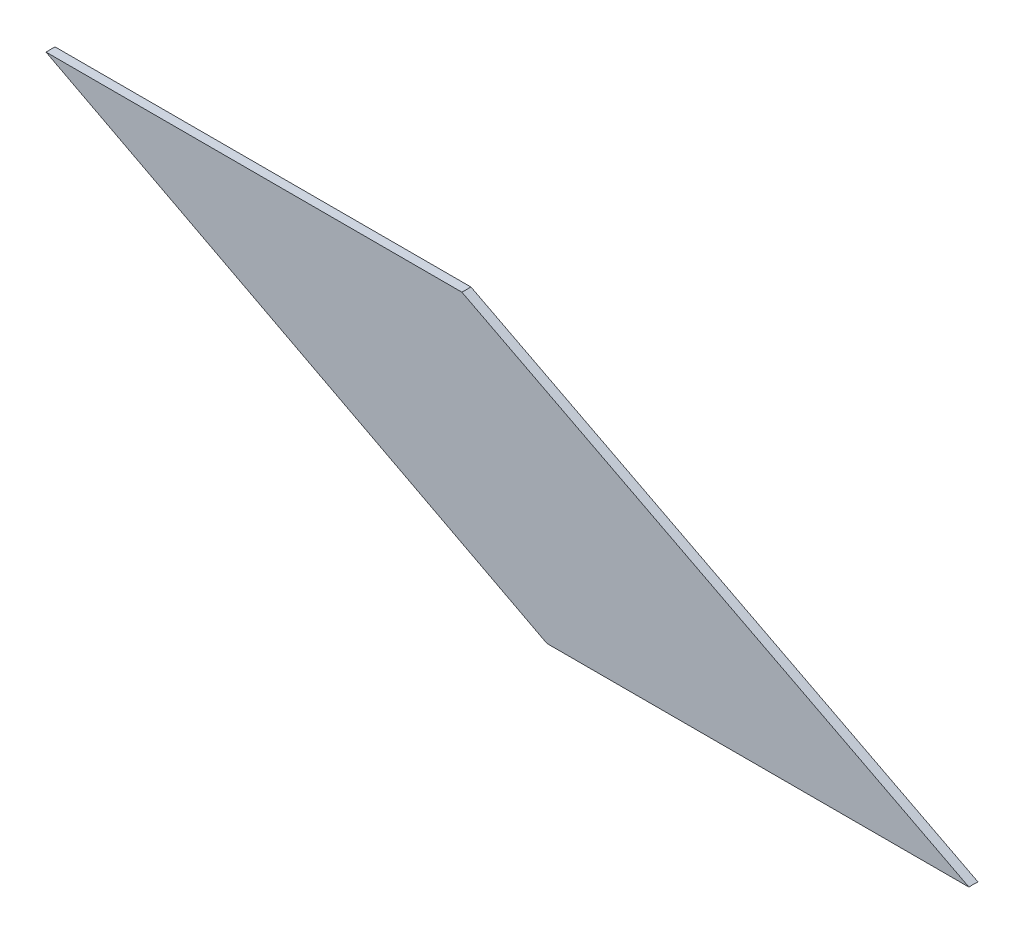
ISO-10303-21;
HEADER;
FILE_DESCRIPTION(('STEP AP214'),'2;1');
FILE_NAME('part.step','',(''),(''),'','','');
FILE_SCHEMA(('AUTOMOTIVE_DESIGN { 1 0 10303 214 1 1 1 1 }'));
ENDSEC;
DATA;
#1=APPLICATION_CONTEXT('core data for automotive mechanical design processes');
#2=APPLICATION_PROTOCOL_DEFINITION('international standard','automotive_design',2000,#1);
#3=PRODUCT_CONTEXT('',#1,'mechanical');
#4=PRODUCT('Part','Part','',(#3));
#5=PRODUCT_RELATED_PRODUCT_CATEGORY('part','',(#4));
#6=PRODUCT_DEFINITION_FORMATION('','',#4);
#7=PRODUCT_DEFINITION_CONTEXT('part definition',#1,'design');
#8=PRODUCT_DEFINITION('design','',#6,#7);
#9=PRODUCT_DEFINITION_SHAPE('','',#8);
#10=(LENGTH_UNIT() NAMED_UNIT(*) SI_UNIT(.MILLI.,.METRE.));
#11=(NAMED_UNIT(*) PLANE_ANGLE_UNIT() SI_UNIT($,.RADIAN.));
#12=(NAMED_UNIT(*) SI_UNIT($,.STERADIAN.) SOLID_ANGLE_UNIT());
#13=UNCERTAINTY_MEASURE_WITH_UNIT(LENGTH_MEASURE(1.E-05),#10,'distance_accuracy_value','');
#14=(GEOMETRIC_REPRESENTATION_CONTEXT(3) GLOBAL_UNCERTAINTY_ASSIGNED_CONTEXT((#13)) GLOBAL_UNIT_ASSIGNED_CONTEXT((#10,
#11,#12)) REPRESENTATION_CONTEXT('',''));
#15=CARTESIAN_POINT('',(0.,0.,0.));
#16=DIRECTION('',(0.,0.,1.));
#17=DIRECTION('',(1.,0.,0.));
#18=AXIS2_PLACEMENT_3D('',#15,#16,#17);
#19=CARTESIAN_POINT('',(-4883.22198910006,44.4999999999994,0.5));
#20=DIRECTION('',(-0.458649554484307,-0.888617232654953,0.));
#21=DIRECTION('',(0.888617232654953,-0.458649554484307,0.));
#22=AXIS2_PLACEMENT_3D('',#19,#20,#21);
#23=PLANE('',#22);
#24=DIRECTION('',(-0.888617232654953,0.458649554484307,0.));
#25=VECTOR('',#24,1.);
#26=CARTESIAN_POINT('',(-4883.22198910006,44.4999999999994,0.5));
#27=LINE('',#26,#25);
#28=CARTESIAN_POINT('',(-4827.01988963607,15.4919333848296,0.5));
#29=VERTEX_POINT('',#28);
#30=CARTESIAN_POINT('',(-4883.22198910006,44.4999999999994,0.5));
#31=VERTEX_POINT('',#30);
#32=EDGE_CURVE('E88',#29,#31,#27,.T.);
#33=ORIENTED_EDGE('',*,*,#32,.F.);
#34=CARTESIAN_POINT('',(-4797.00481856862,0.,0.));
#35=DIRECTION('',(-0.458649554484307,-0.888617232654953,0.));
#36=DIRECTION('',(0.888617232654953,-0.458649554484307,0.));
#37=AXIS2_PLACEMENT_3D('',#34,#35,#36);
#38=ELLIPSE('',#37,33.7948654881564,15.5);
#39=CARTESIAN_POINT('',(-4827.01988963607,15.4919333848297,-0.5));
#40=VERTEX_POINT('',#39);
#41=EDGE_CURVE('E98',#29,#40,#38,.T.);
#42=ORIENTED_EDGE('',*,*,#41,.T.);
#43=DIRECTION('',(-0.888617232654953,0.458649554484307,0.));
#44=VECTOR('',#43,1.);
#45=CARTESIAN_POINT('',(-4883.22198910006,44.4999999999994,-0.5));
#46=LINE('',#45,#44);
#47=CARTESIAN_POINT('',(-4883.22198910006,44.4999999999994,-0.5));
#48=VERTEX_POINT('',#47);
#49=EDGE_CURVE('E80',#40,#48,#46,.T.);
#50=ORIENTED_EDGE('',*,*,#49,.T.);
#51=DIRECTION('',(0.,0.,-1.));
#52=VECTOR('',#51,1.);
#53=CARTESIAN_POINT('',(-4883.22198910006,44.4999999999994,0.5));
#54=LINE('',#53,#52);
#55=EDGE_CURVE('E42',#31,#48,#54,.T.);
#56=ORIENTED_EDGE('',*,*,#55,.F.);
#57=EDGE_LOOP('',(#33,#42,#50,#56));
#58=FACE_BOUND('',#57,.T.);
#59=ADVANCED_FACE('F35',(#58),#23,.F.);
#60=CARTESIAN_POINT('',(-4929.32198910006,44.4999999999994,0.5));
#61=DIRECTION('',(0.,-1.,0.));
#62=DIRECTION('',(0.,0.,-1.));
#63=AXIS2_PLACEMENT_3D('',#60,#61,#62);
#64=PLANE('',#63);
#65=DIRECTION('',(-1.,0.,0.));
#66=VECTOR('',#65,1.);
#67=CARTESIAN_POINT('',(-4929.32198910006,44.4999999999994,-0.5));
#68=LINE('',#67,#66);
#69=CARTESIAN_POINT('',(-4929.32198910006,44.4999999999994,-0.5));
#70=VERTEX_POINT('',#69);
#71=EDGE_CURVE('E70',#48,#70,#68,.T.);
#72=ORIENTED_EDGE('',*,*,#71,.T.);
#73=DIRECTION('',(0.,0.,-1.));
#74=VECTOR('',#73,1.);
#75=CARTESIAN_POINT('',(-4929.32198910006,44.4999999999994,0.5));
#76=LINE('',#75,#74);
#77=CARTESIAN_POINT('',(-4929.32198910006,44.4999999999994,0.5));
#78=VERTEX_POINT('',#77);
#79=EDGE_CURVE('E73',#78,#70,#76,.T.);
#80=ORIENTED_EDGE('',*,*,#79,.F.);
#81=DIRECTION('',(-1.,0.,0.));
#82=VECTOR('',#81,1.);
#83=CARTESIAN_POINT('',(-4929.32198910006,44.4999999999994,0.5));
#84=LINE('',#83,#82);
#85=EDGE_CURVE('E57',#31,#78,#84,.T.);
#86=ORIENTED_EDGE('',*,*,#85,.F.);
#87=ORIENTED_EDGE('',*,*,#55,.T.);
#88=EDGE_LOOP('',(#72,#80,#86,#87));
#89=FACE_BOUND('',#88,.T.);
#90=ADVANCED_FACE('F72',(#89),#64,.F.);
#91=CARTESIAN_POINT('',(-4871.89805391032,14.4999999999994,0.5));
#92=DIRECTION('',(0.463047422660303,0.886333506287363,0.));
#93=DIRECTION('',(-0.886333506287363,0.463047422660303,0.));
#94=AXIS2_PLACEMENT_3D('',#91,#92,#93);
#95=PLANE('',#94);
#96=DIRECTION('',(0.886333506287363,-0.463047422660303,0.));
#97=VECTOR('',#96,1.);
#98=CARTESIAN_POINT('',(-4871.89805391032,14.4999999999994,-0.5));
#99=LINE('',#98,#97);
#100=CARTESIAN_POINT('',(-4873.79674452376,15.4919333848297,-0.5));
#101=VERTEX_POINT('',#100);
#102=EDGE_CURVE('E79',#70,#101,#99,.T.);
#103=ORIENTED_EDGE('',*,*,#102,.T.);
#104=CARTESIAN_POINT('',(-4844.14315190195,0.,0.));
#105=DIRECTION('',(0.463047422660303,0.886333506287363,0.));
#106=DIRECTION('',(0.886333506287363,-0.463047422660303,0.));
#107=AXIS2_PLACEMENT_3D('',#104,#105,#106);
#108=ELLIPSE('',#107,33.4738932590302,15.5);
#109=CARTESIAN_POINT('',(-4873.79674452376,15.4919333848296,0.5));
#110=VERTEX_POINT('',#109);
#111=EDGE_CURVE('E48',#101,#110,#108,.T.);
#112=ORIENTED_EDGE('',*,*,#111,.T.);
#113=DIRECTION('',(0.886333506287363,-0.463047422660303,0.));
#114=VECTOR('',#113,1.);
#115=CARTESIAN_POINT('',(-4871.89805391032,14.4999999999994,0.5));
#116=LINE('',#115,#114);
#117=EDGE_CURVE('E85',#78,#110,#116,.T.);
#118=ORIENTED_EDGE('',*,*,#117,.F.);
#119=ORIENTED_EDGE('',*,*,#79,.T.);
#120=EDGE_LOOP('',(#103,#112,#118,#119));
#121=FACE_BOUND('',#120,.T.);
#122=ADVANCED_FACE('F84',(#121),#95,.F.);
#123=CARTESIAN_POINT('',(0.,0.,0.5));
#124=DIRECTION('',(0.,0.,-1.));
#125=DIRECTION('',(-1.,0.,0.));
#126=AXIS2_PLACEMENT_3D('',#123,#124,#125);
#127=PLANE('',#126);
#128=ORIENTED_EDGE('',*,*,#117,.T.);
#129=DIRECTION('',(1.,0.,0.));
#130=VECTOR('',#129,1.);
#131=CARTESIAN_POINT('',(-4929.32198910006,15.4919333848297,0.5));
#132=LINE('',#131,#130);
#133=EDGE_CURVE('E93',#110,#29,#132,.T.);
#134=ORIENTED_EDGE('',*,*,#133,.T.);
#135=ORIENTED_EDGE('',*,*,#32,.T.);
#136=ORIENTED_EDGE('',*,*,#85,.T.);
#137=EDGE_LOOP('',(#128,#134,#135,#136));
#138=FACE_BOUND('',#137,.T.);
#139=ADVANCED_FACE('F104',(#138),#127,.F.);
#140=CARTESIAN_POINT('',(0.,0.,-0.5));
#141=DIRECTION('',(0.,0.,-1.));
#142=DIRECTION('',(-1.,0.,0.));
#143=AXIS2_PLACEMENT_3D('',#140,#141,#142);
#144=PLANE('',#143);
#145=DIRECTION('',(1.,0.,0.));
#146=VECTOR('',#145,1.);
#147=CARTESIAN_POINT('',(-4929.32198910006,15.4919333848297,-0.5));
#148=LINE('',#147,#146);
#149=EDGE_CURVE('E11',#101,#40,#148,.T.);
#150=ORIENTED_EDGE('',*,*,#149,.F.);
#151=ORIENTED_EDGE('',*,*,#102,.F.);
#152=ORIENTED_EDGE('',*,*,#71,.F.);
#153=ORIENTED_EDGE('',*,*,#49,.F.);
#154=EDGE_LOOP('',(#150,#151,#152,#153));
#155=FACE_BOUND('',#154,.T.);
#156=ADVANCED_FACE('F87',(#155),#144,.T.);
#157=CARTESIAN_POINT('',(-4929.32198910006,0.,0.));
#158=DIRECTION('',(1.,0.,0.));
#159=DIRECTION('',(0.,0.,-1.));
#160=AXIS2_PLACEMENT_3D('',#157,#158,#159);
#161=CYLINDRICAL_SURFACE('',#160,15.5);
#162=ORIENTED_EDGE('',*,*,#111,.F.);
#163=ORIENTED_EDGE('',*,*,#149,.T.);
#164=ORIENTED_EDGE('',*,*,#41,.F.);
#165=ORIENTED_EDGE('',*,*,#133,.F.);
#166=EDGE_LOOP('',(#162,#163,#164,#165));
#167=FACE_BOUND('',#166,.T.);
#168=ADVANCED_FACE('F109',(#167),#161,.F.);
#169=CLOSED_SHELL('',(#59,#90,#122,#139,#156,#168));
#170=MANIFOLD_SOLID_BREP('B2',#169);
#171=ADVANCED_BREP_SHAPE_REPRESENTATION('',(#18,#170),#14);
#172=SHAPE_DEFINITION_REPRESENTATION(#9,#171);
ENDSEC;
END-ISO-10303-21;
